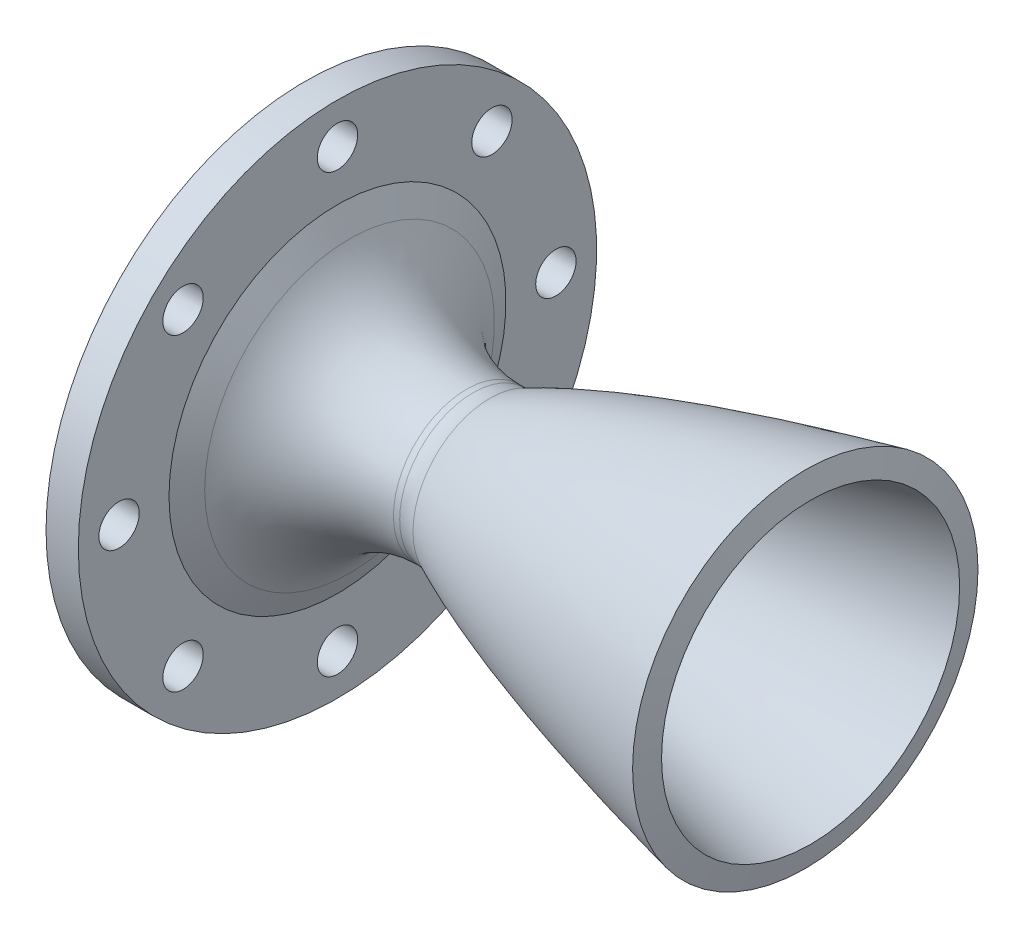
ISO-10303-21;
HEADER;
FILE_DESCRIPTION(('STEP AP214'),'2;1');
FILE_NAME('part.step','',(''),(''),'','','');
FILE_SCHEMA(('AUTOMOTIVE_DESIGN { 1 0 10303 214 1 1 1 1 }'));
ENDSEC;
DATA;
#1=APPLICATION_CONTEXT('core data for automotive mechanical design processes');
#2=APPLICATION_PROTOCOL_DEFINITION('international standard','automotive_design',2000,#1);
#3=PRODUCT_CONTEXT('',#1,'mechanical');
#4=PRODUCT('Part','Part','',(#3));
#5=PRODUCT_RELATED_PRODUCT_CATEGORY('part','',(#4));
#6=PRODUCT_DEFINITION_FORMATION('','',#4);
#7=PRODUCT_DEFINITION_CONTEXT('part definition',#1,'design');
#8=PRODUCT_DEFINITION('design','',#6,#7);
#9=PRODUCT_DEFINITION_SHAPE('','',#8);
#10=(LENGTH_UNIT() NAMED_UNIT(*) SI_UNIT(.MILLI.,.METRE.));
#11=(NAMED_UNIT(*) PLANE_ANGLE_UNIT() SI_UNIT($,.RADIAN.));
#12=(NAMED_UNIT(*) SI_UNIT($,.STERADIAN.) SOLID_ANGLE_UNIT());
#13=UNCERTAINTY_MEASURE_WITH_UNIT(LENGTH_MEASURE(1.E-05),#10,'distance_accuracy_value','');
#14=(GEOMETRIC_REPRESENTATION_CONTEXT(3) GLOBAL_UNCERTAINTY_ASSIGNED_CONTEXT((#13)) GLOBAL_UNIT_ASSIGNED_CONTEXT((#10,
#11,#12)) REPRESENTATION_CONTEXT('',''));
#15=CARTESIAN_POINT('',(0.,0.,0.));
#16=DIRECTION('',(0.,0.,1.));
#17=DIRECTION('',(1.,0.,0.));
#18=AXIS2_PLACEMENT_3D('',#15,#16,#17);
#19=CARTESIAN_POINT('',(-40.1017859271081,2.47516664872048,0.));
#20=DIRECTION('',(-1.,0.,0.));
#21=DIRECTION('',(0.,0.,1.));
#22=AXIS2_PLACEMENT_3D('',#19,#20,#21);
#23=CYLINDRICAL_SURFACE('',#22,32.1);
#24=CARTESIAN_POINT('',(-33.8674942617317,2.47516664872048,0.));
#25=DIRECTION('',(-1.,0.,0.));
#26=DIRECTION('',(0.,0.,1.));
#27=AXIS2_PLACEMENT_3D('',#24,#25,#26);
#28=CIRCLE('',#27,32.1);
#29=CARTESIAN_POINT('',(-33.8674942617317,2.47516664872048,32.1));
#30=VERTEX_POINT('',#29);
#31=EDGE_CURVE('E56',#30,#30,#28,.T.);
#32=ORIENTED_EDGE('',*,*,#31,.F.);
#33=EDGE_LOOP('',(#32));
#34=FACE_BOUND('',#33,.T.);
#35=CARTESIAN_POINT('',(-29.8674942617317,2.47516664872048,0.));
#36=DIRECTION('',(-1.,0.,0.));
#37=DIRECTION('',(0.,0.,1.));
#38=AXIS2_PLACEMENT_3D('',#35,#36,#37);
#39=CIRCLE('',#38,32.1);
#40=CARTESIAN_POINT('',(-29.8674942617317,2.47516664872048,32.1));
#41=VERTEX_POINT('',#40);
#42=EDGE_CURVE('E139',#41,#41,#39,.T.);
#43=ORIENTED_EDGE('',*,*,#42,.T.);
#44=EDGE_LOOP('',(#43));
#45=FACE_BOUND('',#44,.T.);
#46=ADVANCED_FACE('F43',(#34,#45),#23,.T.);
#47=CARTESIAN_POINT('',(-33.8674942617317,24.5751666487205,0.));
#48=DIRECTION('',(1.,0.,0.));
#49=DIRECTION('',(0.,0.,-1.));
#50=AXIS2_PLACEMENT_3D('',#47,#48,#49);
#51=PLANE('',#50);
#52=CARTESIAN_POINT('',(-33.8674942617317,29.5751666487205,0.));
#53=DIRECTION('',(1.,0.,0.));
#54=DIRECTION('',(0.,0.,-1.));
#55=AXIS2_PLACEMENT_3D('',#52,#53,#54);
#56=CIRCLE('',#55,2.5);
#57=CARTESIAN_POINT('',(-33.8674942617317,29.5751666487205,-2.5));
#58=VERTEX_POINT('',#57);
#59=EDGE_CURVE('E68',#58,#58,#56,.T.);
#60=ORIENTED_EDGE('',*,*,#59,.T.);
#61=EDGE_LOOP('',(#60));
#62=FACE_BOUND('',#61,.T.);
#63=CARTESIAN_POINT('',(-33.8674942617317,21.6521480783193,19.1278588875964));
#64=DIRECTION('',(1.,0.,0.));
#65=DIRECTION('',(0.,0.,-1.));
#66=AXIS2_PLACEMENT_3D('',#63,#64,#65);
#67=CIRCLE('',#66,2.5);
#68=CARTESIAN_POINT('',(-33.8674942617317,21.6521480783193,16.6278588875964));
#69=VERTEX_POINT('',#68);
#70=EDGE_CURVE('E69',#69,#69,#67,.T.);
#71=ORIENTED_EDGE('',*,*,#70,.T.);
#72=EDGE_LOOP('',(#71));
#73=FACE_BOUND('',#72,.T.);
#74=CARTESIAN_POINT('',(-33.8674942617317,2.52428919072291,27.0508774579976));
#75=DIRECTION('',(1.,0.,0.));
#76=DIRECTION('',(0.,0.,-1.));
#77=AXIS2_PLACEMENT_3D('',#74,#75,#76);
#78=CIRCLE('',#77,2.5);
#79=CARTESIAN_POINT('',(-33.8674942617317,2.52428919072291,24.5508774579976));
#80=VERTEX_POINT('',#79);
#81=EDGE_CURVE('E74',#80,#80,#78,.T.);
#82=ORIENTED_EDGE('',*,*,#81,.T.);
#83=EDGE_LOOP('',(#82));
#84=FACE_BOUND('',#83,.T.);
#85=CARTESIAN_POINT('',(-33.8674942617317,-16.6035696968735,19.1278588875964));
#86=DIRECTION('',(1.,0.,0.));
#87=DIRECTION('',(0.,0.,-1.));
#88=AXIS2_PLACEMENT_3D('',#85,#86,#87);
#89=CIRCLE('',#88,2.5);
#90=CARTESIAN_POINT('',(-33.8674942617317,-16.6035696968735,16.6278588875964));
#91=VERTEX_POINT('',#90);
#92=EDGE_CURVE('E79',#91,#91,#89,.T.);
#93=ORIENTED_EDGE('',*,*,#92,.T.);
#94=EDGE_LOOP('',(#93));
#95=FACE_BOUND('',#94,.T.);
#96=CARTESIAN_POINT('',(-33.8674942617317,-24.5265882672746,0.));
#97=DIRECTION('',(1.,0.,0.));
#98=DIRECTION('',(0.,0.,-1.));
#99=AXIS2_PLACEMENT_3D('',#96,#97,#98);
#100=CIRCLE('',#99,2.5);
#101=CARTESIAN_POINT('',(-33.8674942617317,-24.5265882672746,-2.5));
#102=VERTEX_POINT('',#101);
#103=EDGE_CURVE('E84',#102,#102,#100,.T.);
#104=ORIENTED_EDGE('',*,*,#103,.T.);
#105=EDGE_LOOP('',(#104));
#106=FACE_BOUND('',#105,.T.);
#107=CARTESIAN_POINT('',(-33.8674942617317,-16.6035696968735,-19.1278588875964));
#108=DIRECTION('',(1.,0.,0.));
#109=DIRECTION('',(0.,0.,-1.));
#110=AXIS2_PLACEMENT_3D('',#107,#108,#109);
#111=CIRCLE('',#110,2.5);
#112=CARTESIAN_POINT('',(-33.8674942617317,-16.6035696968735,-21.6278588875964));
#113=VERTEX_POINT('',#112);
#114=EDGE_CURVE('E89',#113,#113,#111,.T.);
#115=ORIENTED_EDGE('',*,*,#114,.T.);
#116=EDGE_LOOP('',(#115));
#117=FACE_BOUND('',#116,.T.);
#118=CARTESIAN_POINT('',(-33.8674942617317,2.52428919072291,-27.0508774579976));
#119=DIRECTION('',(1.,0.,0.));
#120=DIRECTION('',(0.,0.,-1.));
#121=AXIS2_PLACEMENT_3D('',#118,#119,#120);
#122=CIRCLE('',#121,2.5);
#123=CARTESIAN_POINT('',(-33.8674942617317,2.52428919072291,-29.5508774579976));
#124=VERTEX_POINT('',#123);
#125=EDGE_CURVE('E94',#124,#124,#122,.T.);
#126=ORIENTED_EDGE('',*,*,#125,.T.);
#127=EDGE_LOOP('',(#126));
#128=FACE_BOUND('',#127,.T.);
#129=CARTESIAN_POINT('',(-33.8674942617317,21.6521480783193,-19.1278588875964));
#130=DIRECTION('',(1.,0.,0.));
#131=DIRECTION('',(0.,0.,-1.));
#132=AXIS2_PLACEMENT_3D('',#129,#130,#131);
#133=CIRCLE('',#132,2.5);
#134=CARTESIAN_POINT('',(-33.8674942617317,21.6521480783193,-21.6278588875964));
#135=VERTEX_POINT('',#134);
#136=EDGE_CURVE('E99',#135,#135,#133,.T.);
#137=ORIENTED_EDGE('',*,*,#136,.T.);
#138=EDGE_LOOP('',(#137));
#139=FACE_BOUND('',#138,.T.);
#140=CARTESIAN_POINT('',(-33.8674942617317,2.47516664872048,0.));
#141=DIRECTION('',(-1.,0.,0.));
#142=DIRECTION('',(0.,0.,1.));
#143=AXIS2_PLACEMENT_3D('',#140,#141,#142);
#144=CIRCLE('',#143,22.1);
#145=CARTESIAN_POINT('',(-33.8674942617317,2.47516664872048,22.1));
#146=VERTEX_POINT('',#145);
#147=EDGE_CURVE('E61',#146,#146,#144,.T.);
#148=ORIENTED_EDGE('',*,*,#147,.F.);
#149=EDGE_LOOP('',(#148));
#150=FACE_BOUND('',#149,.T.);
#151=ORIENTED_EDGE('',*,*,#31,.T.);
#152=EDGE_LOOP('',(#151));
#153=FACE_BOUND('',#152,.T.);
#154=ADVANCED_FACE('F180',(#62,#73,#84,#95,#106,#117,#128,#139,#150,#153),#51,.F.);
#155=CARTESIAN_POINT('',(-33.8674942617317,2.47516664872048,0.));
#156=DIRECTION('',(-1.,0.,0.));
#157=DIRECTION('',(0.,0.,1.));
#158=AXIS2_PLACEMENT_3D('',#155,#156,#157);
#159=CONICAL_SURFACE('',#158,22.1,1.09804226754378);
#160=CARTESIAN_POINT('',(-31.0429654311442,2.47516664872048,0.));
#161=DIRECTION('',(-1.,0.,0.));
#162=DIRECTION('',(0.,0.,1.));
#163=AXIS2_PLACEMENT_3D('',#160,#161,#162);
#164=CIRCLE('',#163,16.5772525121334);
#165=CARTESIAN_POINT('',(-31.0429654311442,2.47516664872048,16.5772525121334));
#166=VERTEX_POINT('',#165);
#167=EDGE_CURVE('E107',#166,#166,#164,.T.);
#168=ORIENTED_EDGE('',*,*,#167,.F.);
#169=EDGE_LOOP('',(#168));
#170=FACE_BOUND('',#169,.T.);
#171=ORIENTED_EDGE('',*,*,#147,.T.);
#172=EDGE_LOOP('',(#171));
#173=FACE_BOUND('',#172,.T.);
#174=ADVANCED_FACE('F176',(#170,#173),#159,.F.);
#175=CARTESIAN_POINT('',(-13.8674942617317,2.47516664872048,0.));
#176=DIRECTION('',(-1.,0.,0.));
#177=DIRECTION('',(0.,0.,1.));
#178=AXIS2_PLACEMENT_3D('',#175,#176,#177);
#179=TOROIDAL_SURFACE('',#178,25.3613972885354,19.2913972885354);
#180=CARTESIAN_POINT('',(-13.8674942617317,2.47516664872048,0.));
#181=DIRECTION('',(-1.,0.,0.));
#182=DIRECTION('',(0.,0.,1.));
#183=AXIS2_PLACEMENT_3D('',#180,#181,#182);
#184=CIRCLE('',#183,6.07);
#185=CARTESIAN_POINT('',(-13.8674942617317,2.47516664872048,6.07));
#186=VERTEX_POINT('',#185);
#187=EDGE_CURVE('E111',#186,#186,#184,.T.);
#188=ORIENTED_EDGE('',*,*,#187,.F.);
#189=EDGE_LOOP('',(#188));
#190=FACE_BOUND('',#189,.T.);
#191=ORIENTED_EDGE('',*,*,#167,.T.);
#192=EDGE_LOOP('',(#191));
#193=FACE_BOUND('',#192,.T.);
#194=ADVANCED_FACE('F172',(#190,#193),#179,.T.);
#195=CARTESIAN_POINT('',(-40.1017859271081,2.47516664872048,0.));
#196=DIRECTION('',(-1.,0.,0.));
#197=DIRECTION('',(0.,0.,1.));
#198=AXIS2_PLACEMENT_3D('',#195,#196,#197);
#199=CYLINDRICAL_SURFACE('',#198,6.07);
#200=CARTESIAN_POINT('',(-11.2628437187715,2.47516664872048,0.));
#201=DIRECTION('',(-1.,0.,0.));
#202=DIRECTION('',(0.,0.,1.));
#203=AXIS2_PLACEMENT_3D('',#200,#201,#202);
#204=CIRCLE('',#203,6.07);
#205=CARTESIAN_POINT('',(-11.2628437187715,2.47516664872048,6.07));
#206=VERTEX_POINT('',#205);
#207=EDGE_CURVE('E115',#206,#206,#204,.T.);
#208=ORIENTED_EDGE('',*,*,#207,.F.);
#209=EDGE_LOOP('',(#208));
#210=FACE_BOUND('',#209,.T.);
#211=ORIENTED_EDGE('',*,*,#187,.T.);
#212=EDGE_LOOP('',(#211));
#213=FACE_BOUND('',#212,.T.);
#214=ADVANCED_FACE('F168',(#210,#213),#199,.F.);
#215=CARTESIAN_POINT('',(-11.2628437202166,8.5451666479965,0.));
#216=CARTESIAN_POINT('',(-11.1704410594149,8.59146234340708,0.));
#217=CARTESIAN_POINT('',(-10.9844878029856,8.68381146286285,0.));
#218=CARTESIAN_POINT('',(-10.5754895652672,8.88511502759375,0.));
#219=CARTESIAN_POINT('',(-10.1540615575437,9.08690757135863,0.));
#220=CARTESIAN_POINT('',(-9.67974792358082,9.3101856655338,0.));
#221=CARTESIAN_POINT('',(-9.18413714819353,9.53859943746503,0.));
#222=CARTESIAN_POINT('',(-8.63042617002927,9.78843016685588,0.));
#223=CARTESIAN_POINT('',(-8.01773238720454,10.0585048172262,0.));
#224=CARTESIAN_POINT('',(-7.19862191742622,10.4109854677113,0.));
#225=CARTESIAN_POINT('',(-6.17022199762688,10.8392437244766,0.));
#226=CARTESIAN_POINT('',(-4.96382019129255,11.3227369794277,0.));
#227=CARTESIAN_POINT('',(-3.57729882308945,11.8554320342333,0.));
#228=CARTESIAN_POINT('',(-2.14581567337746,12.3842839961738,0.));
#229=CARTESIAN_POINT('',(-0.358215928535983,13.0201995624111,0.));
#230=CARTESIAN_POINT('',(1.79014760564762,13.7495427125451,0.));
#231=CARTESIAN_POINT('',(4.30301149567443,14.5589411782354,0.));
#232=CARTESIAN_POINT('',(7.14474206251522,15.4251988551575,0.));
#233=CARTESIAN_POINT('',(9.9976094890332,16.2526182286502,0.));
#234=CARTESIAN_POINT('',(12.5028743400638,16.9469022464837,0.));
#235=CARTESIAN_POINT('',(14.6544906366279,17.5228768796072,0.));
#236=CARTESIAN_POINT('',(16.4519604173846,17.9915371934645,0.));
#237=CARTESIAN_POINT('',(17.8891445557143,18.3592888307294,0.));
#238=CARTESIAN_POINT('',(19.333055984898,18.7219091745531,0.));
#239=CARTESIAN_POINT('',(20.7689304476629,19.0764140294032,0.));
#240=CARTESIAN_POINT('',(22.0424827452051,19.3852006192132,0.));
#241=CARTESIAN_POINT('',(23.1087890028986,19.6406136155214,0.));
#242=CARTESIAN_POINT('',(24.0407741960624,19.8608930084722,0.));
#243=CARTESIAN_POINT('',(24.7076264255003,20.0180909903611,0.));
#244=CARTESIAN_POINT('',(25.7285162119527,20.2549834255515,0.));
#245=CARTESIAN_POINT('',(26.575325658845,20.45176279906,0.));
#246=CARTESIAN_POINT('',(27.8069779563923,20.7312022339886,0.));
#247=CARTESIAN_POINT('',(28.4245227349194,20.87060224574,0.));
#248=CARTESIAN_POINT('',(28.7270485219971,20.9385085280617,0.));
#249=B_SPLINE_CURVE_WITH_KNOTS('',4,(#215,#216,#217,#218,#219,#220,#221,#222,#223,#224,#225,
#226,#227,#228,#229,#230,#231,#232,#233,#234,#235,#236,#237,#238,#239,#240,#241,#242,#243,#244,
#245,#246,#247,#248),.UNSPECIFIED.,.F.,.F.,(5,1,1,1,1,1,1,1,1,1,1,1,1,1,1,1,1,1,1,1,1,1,1,1,1,1,
1,1,1,1,5),(0.0834996550678079,0.093353560602658,0.103207466177351,0.113061323495502,
0.122915180813652,0.134784595530776,0.146654010247901,0.161434814833603,0.176215619419305,
0.205777187867874,0.235338798099936,0.264900393411024,0.294461996100397,0.327264292288231,
0.386387484255726,0.445510682453015,0.504633878157806,0.563757076826583,0.622880273665945,
0.652441872787443,0.682003471908941,0.711565070450698,0.741126668992456,0.770688267582537,
0.800249866172618,0.815030665389756,0.829811464606894,0.844592263824031,0.859373063041169,
0.888934660882481,0.918496258762739),.UNSPECIFIED.);
#250=CARTESIAN_POINT('',(-40.1017859271081,2.47516664872048,0.));
#251=DIRECTION('',(-1.,0.,0.));
#252=AXIS1_PLACEMENT('',#250,#251);
#253=SURFACE_OF_REVOLUTION('',#249,#252);
#254=CARTESIAN_POINT('',(28.7270485219971,2.47516664872048,0.));
#255=DIRECTION('',(-1.,0.,0.));
#256=DIRECTION('',(0.,0.,1.));
#257=AXIS2_PLACEMENT_3D('',#254,#255,#256);
#258=CIRCLE('',#257,18.4633418793413);
#259=CARTESIAN_POINT('',(28.7270485219971,2.47516664872048,18.4633418793413));
#260=VERTEX_POINT('',#259);
#261=EDGE_CURVE('E119',#260,#260,#258,.T.);
#262=ORIENTED_EDGE('',*,*,#261,.F.);
#263=EDGE_LOOP('',(#262));
#264=FACE_BOUND('',#263,.T.);
#265=ORIENTED_EDGE('',*,*,#207,.T.);
#266=EDGE_LOOP('',(#265));
#267=FACE_BOUND('',#266,.T.);
#268=ADVANCED_FACE('F164',(#264,#267),#253,.T.);
#269=CARTESIAN_POINT('',(28.7270485219971,2.47516664872048,0.));
#270=DIRECTION('',(-1.,0.,0.));
#271=DIRECTION('',(0.,0.,1.));
#272=AXIS2_PLACEMENT_3D('',#269,#270,#271);
#273=CONICAL_SURFACE('',#272,18.4633418793413,1.34999169417867);
#274=CARTESIAN_POINT('',(28.0700041481886,2.47516664872048,0.));
#275=DIRECTION('',(-1.,0.,0.));
#276=DIRECTION('',(0.,0.,1.));
#277=AXIS2_PLACEMENT_3D('',#274,#275,#276);
#278=CIRCLE('',#277,21.3905064956306);
#279=CARTESIAN_POINT('',(28.0700041481886,2.47516664872048,21.3905064956306));
#280=VERTEX_POINT('',#279);
#281=EDGE_CURVE('E123',#280,#280,#278,.T.);
#282=ORIENTED_EDGE('',*,*,#281,.F.);
#283=EDGE_LOOP('',(#282));
#284=FACE_BOUND('',#283,.T.);
#285=ORIENTED_EDGE('',*,*,#261,.T.);
#286=EDGE_LOOP('',(#285));
#287=FACE_BOUND('',#286,.T.);
#288=ADVANCED_FACE('F160',(#284,#287),#273,.T.);
#289=CARTESIAN_POINT('',(28.0700041481886,23.8656731443511,0.));
#290=CARTESIAN_POINT('',(27.8838609494425,23.8238906149083,0.));
#291=CARTESIAN_POINT('',(27.5362959126043,23.7455767317207,0.));
#292=CARTESIAN_POINT('',(26.8671961300056,23.5940376090018,0.));
#293=CARTESIAN_POINT('',(26.1454585299366,23.4297612432549,0.));
#294=CARTESIAN_POINT('',(25.5057430237634,23.2829363894341,0.));
#295=CARTESIAN_POINT('',(24.939210748867,23.1515877312432,0.));
#296=CARTESIAN_POINT('',(24.2697193061066,22.9961872139758,0.));
#297=CARTESIAN_POINT('',(23.6318451829211,22.8468094359267,0.));
#298=CARTESIAN_POINT('',(22.814394965333,22.6537959030994,0.));
#299=CARTESIAN_POINT('',(21.7395946282258,22.3979654484581,0.));
#300=CARTESIAN_POINT('',(20.0676608588631,21.9936593435639,0.));
#301=CARTESIAN_POINT('',(15.4289598895864,20.8476938232466,0.));
#302=CARTESIAN_POINT('',(7.88585049956268,18.8369735409048,0.));
#303=CARTESIAN_POINT('',(-0.45019804706077,16.2334151294487,0.));
#304=CARTESIAN_POINT('',(-6.23354237038004,14.0718446080339,0.));
#305=CARTESIAN_POINT('',(-9.09923833167396,12.8677094942143,0.));
#306=CARTESIAN_POINT('',(-10.5335314646272,12.2219759600956,0.));
#307=CARTESIAN_POINT('',(-11.3385785504298,11.8458776384617,0.));
#308=CARTESIAN_POINT('',(-11.7564571363918,11.6456193257171,0.));
#309=CARTESIAN_POINT('',(-11.9625824642066,11.5451666487204,0.));
#310=B_SPLINE_CURVE_WITH_KNOTS('',3,(#289,#290,#291,#292,#293,#294,#295,#296,#297,#298,#299,
#300,#301,#302,#303,#304,#305,#306,#307,#308,#309),.UNSPECIFIED.,.F.,.F.,(4,1,1,1,1,1,1,1,1,1,1,
1,1,1,1,1,1,1,4),(0.0972888627316728,0.110120228294638,0.122951593857603,0.135782959420568,
0.148614324983533,0.161445690546498,0.174277056109463,0.187108421672428,0.199939787235393,
0.225602518361323,0.251265249487253,0.302590711739113,0.507892560746554,0.713194409753994,
0.815845334257714,0.867170796509574,0.892833527635504,0.905664893198469,0.918496258761434),.UNSPECIFIED.);
#311=CARTESIAN_POINT('',(-40.1017859271081,2.47516664872048,0.));
#312=DIRECTION('',(-1.,0.,0.));
#313=AXIS1_PLACEMENT('',#311,#312);
#314=SURFACE_OF_REVOLUTION('',#310,#313);
#315=CARTESIAN_POINT('',(-10.9793210498691,2.47516664872048,0.));
#316=DIRECTION('',(-1.,0.,0.));
#317=DIRECTION('',(0.,0.,1.));
#318=AXIS2_PLACEMENT_3D('',#315,#316,#317);
#319=CIRCLE('',#318,9.53821959961478);
#320=CARTESIAN_POINT('',(-10.9793210498691,2.47516664872048,9.53821959961478));
#321=VERTEX_POINT('',#320);
#322=EDGE_CURVE('E10',#321,#321,#319,.F.);
#323=ORIENTED_EDGE('',*,*,#322,.T.);
#324=EDGE_LOOP('',(#323));
#325=FACE_BOUND('',#324,.T.);
#326=ORIENTED_EDGE('',*,*,#281,.T.);
#327=EDGE_LOOP('',(#326));
#328=FACE_BOUND('',#327,.T.);
#329=ADVANCED_FACE('F155',(#325,#328),#314,.T.);
#330=CARTESIAN_POINT('',(-40.1017859271081,2.47516664872048,0.));
#331=DIRECTION('',(-1.,0.,0.));
#332=DIRECTION('',(0.,0.,1.));
#333=AXIS2_PLACEMENT_3D('',#330,#331,#332);
#334=CYLINDRICAL_SURFACE('',#333,9.06999999999996);
#335=CARTESIAN_POINT('',(-13.0918944575131,2.47516664872048,0.));
#336=DIRECTION('',(-1.,0.,0.));
#337=DIRECTION('',(0.,0.,1.));
#338=AXIS2_PLACEMENT_3D('',#335,#336,#337);
#339=CIRCLE('',#338,9.06999999999996);
#340=CARTESIAN_POINT('',(-13.0918944575131,2.47516664872048,9.06999999999996));
#341=VERTEX_POINT('',#340);
#342=EDGE_CURVE('E51',#341,#341,#339,.T.);
#343=ORIENTED_EDGE('',*,*,#342,.T.);
#344=EDGE_LOOP('',(#343));
#345=FACE_BOUND('',#344,.T.);
#346=CARTESIAN_POINT('',(-13.8674942617317,2.47516664872048,0.));
#347=DIRECTION('',(-1.,0.,0.));
#348=DIRECTION('',(0.,0.,1.));
#349=AXIS2_PLACEMENT_3D('',#346,#347,#348);
#350=CIRCLE('',#349,9.07);
#351=CARTESIAN_POINT('',(-13.8674942617317,2.47516664872048,9.07));
#352=VERTEX_POINT('',#351);
#353=EDGE_CURVE('E127',#352,#352,#350,.T.);
#354=ORIENTED_EDGE('',*,*,#353,.F.);
#355=EDGE_LOOP('',(#354));
#356=FACE_BOUND('',#355,.T.);
#357=ADVANCED_FACE('F159',(#345,#356),#334,.T.);
#358=CARTESIAN_POINT('',(-13.8674942617317,2.47516664872048,0.));
#359=DIRECTION('',(-1.,0.,0.));
#360=DIRECTION('',(0.,0.,1.));
#361=AXIS2_PLACEMENT_3D('',#358,#359,#360);
#362=TOROIDAL_SURFACE('',#361,25.3613972885354,16.2913972885354);
#363=CARTESIAN_POINT('',(-28.3720125324208,2.47516664872048,0.));
#364=DIRECTION('',(-1.,0.,0.));
#365=DIRECTION('',(0.,0.,1.));
#366=AXIS2_PLACEMENT_3D('',#363,#364,#365);
#367=CIRCLE('',#366,17.9432725020316);
#368=CARTESIAN_POINT('',(-28.3720125324208,2.47516664872048,17.9432725020316));
#369=VERTEX_POINT('',#368);
#370=EDGE_CURVE('E131',#369,#369,#367,.T.);
#371=ORIENTED_EDGE('',*,*,#370,.F.);
#372=EDGE_LOOP('',(#371));
#373=FACE_BOUND('',#372,.T.);
#374=ORIENTED_EDGE('',*,*,#353,.T.);
#375=EDGE_LOOP('',(#374));
#376=FACE_BOUND('',#375,.T.);
#377=ADVANCED_FACE('F203',(#373,#376),#362,.F.);
#378=CARTESIAN_POINT('',(-28.3720125324208,2.47516664872048,0.));
#379=DIRECTION('',(-1.,0.,0.));
#380=DIRECTION('',(0.,0.,1.));
#381=AXIS2_PLACEMENT_3D('',#378,#379,#380);
#382=CONICAL_SURFACE('',#381,17.9432725020316,1.09804226754377);
#383=CARTESIAN_POINT('',(-29.8674942617317,2.47516664872048,0.));
#384=DIRECTION('',(-1.,0.,0.));
#385=DIRECTION('',(0.,0.,1.));
#386=AXIS2_PLACEMENT_3D('',#383,#384,#385);
#387=CIRCLE('',#386,20.8673594769143);
#388=CARTESIAN_POINT('',(-29.8674942617317,2.47516664872048,20.8673594769143));
#389=VERTEX_POINT('',#388);
#390=EDGE_CURVE('E135',#389,#389,#387,.T.);
#391=ORIENTED_EDGE('',*,*,#390,.F.);
#392=EDGE_LOOP('',(#391));
#393=FACE_BOUND('',#392,.T.);
#394=ORIENTED_EDGE('',*,*,#370,.T.);
#395=EDGE_LOOP('',(#394));
#396=FACE_BOUND('',#395,.T.);
#397=ADVANCED_FACE('F196',(#393,#396),#382,.T.);
#398=CARTESIAN_POINT('',(-29.8674942617317,23.3425261256348,0.));
#399=DIRECTION('',(-1.,0.,0.));
#400=DIRECTION('',(0.,0.,1.));
#401=AXIS2_PLACEMENT_3D('',#398,#399,#400);
#402=PLANE('',#401);
#403=CARTESIAN_POINT('',(-29.8674942617317,29.5751666487205,0.));
#404=DIRECTION('',(-1.,0.,0.));
#405=DIRECTION('',(0.,0.,1.));
#406=AXIS2_PLACEMENT_3D('',#403,#404,#405);
#407=CIRCLE('',#406,2.5);
#408=CARTESIAN_POINT('',(-29.8674942617317,29.5751666487205,2.5));
#409=VERTEX_POINT('',#408);
#410=EDGE_CURVE('E64',#409,#409,#407,.T.);
#411=ORIENTED_EDGE('',*,*,#410,.T.);
#412=EDGE_LOOP('',(#411));
#413=FACE_BOUND('',#412,.T.);
#414=CARTESIAN_POINT('',(-29.8674942617317,21.6521480783193,19.1278588875964));
#415=DIRECTION('',(-1.,0.,0.));
#416=DIRECTION('',(0.,0.,1.));
#417=AXIS2_PLACEMENT_3D('',#414,#415,#416);
#418=CIRCLE('',#417,2.5);
#419=CARTESIAN_POINT('',(-29.8674942617317,21.6521480783193,21.6278588875964));
#420=VERTEX_POINT('',#419);
#421=EDGE_CURVE('E70',#420,#420,#418,.T.);
#422=ORIENTED_EDGE('',*,*,#421,.T.);
#423=EDGE_LOOP('',(#422));
#424=FACE_BOUND('',#423,.T.);
#425=CARTESIAN_POINT('',(-29.8674942617317,2.52428919072291,27.0508774579976));
#426=DIRECTION('',(-1.,0.,0.));
#427=DIRECTION('',(0.,0.,1.));
#428=AXIS2_PLACEMENT_3D('',#425,#426,#427);
#429=CIRCLE('',#428,2.5);
#430=CARTESIAN_POINT('',(-29.8674942617317,2.52428919072291,29.5508774579976));
#431=VERTEX_POINT('',#430);
#432=EDGE_CURVE('E75',#431,#431,#429,.T.);
#433=ORIENTED_EDGE('',*,*,#432,.T.);
#434=EDGE_LOOP('',(#433));
#435=FACE_BOUND('',#434,.T.);
#436=CARTESIAN_POINT('',(-29.8674942617317,-16.6035696968735,19.1278588875964));
#437=DIRECTION('',(-1.,0.,0.));
#438=DIRECTION('',(0.,0.,1.));
#439=AXIS2_PLACEMENT_3D('',#436,#437,#438);
#440=CIRCLE('',#439,2.5);
#441=CARTESIAN_POINT('',(-29.8674942617317,-16.6035696968735,21.6278588875964));
#442=VERTEX_POINT('',#441);
#443=EDGE_CURVE('E80',#442,#442,#440,.T.);
#444=ORIENTED_EDGE('',*,*,#443,.T.);
#445=EDGE_LOOP('',(#444));
#446=FACE_BOUND('',#445,.T.);
#447=CARTESIAN_POINT('',(-29.8674942617317,-24.5265882672746,0.));
#448=DIRECTION('',(-1.,0.,0.));
#449=DIRECTION('',(0.,0.,1.));
#450=AXIS2_PLACEMENT_3D('',#447,#448,#449);
#451=CIRCLE('',#450,2.5);
#452=CARTESIAN_POINT('',(-29.8674942617317,-24.5265882672746,2.5));
#453=VERTEX_POINT('',#452);
#454=EDGE_CURVE('E85',#453,#453,#451,.T.);
#455=ORIENTED_EDGE('',*,*,#454,.T.);
#456=EDGE_LOOP('',(#455));
#457=FACE_BOUND('',#456,.T.);
#458=CARTESIAN_POINT('',(-29.8674942617317,-16.6035696968735,-19.1278588875964));
#459=DIRECTION('',(-1.,0.,0.));
#460=DIRECTION('',(0.,0.,1.));
#461=AXIS2_PLACEMENT_3D('',#458,#459,#460);
#462=CIRCLE('',#461,2.5);
#463=CARTESIAN_POINT('',(-29.8674942617317,-16.6035696968735,-16.6278588875964));
#464=VERTEX_POINT('',#463);
#465=EDGE_CURVE('E90',#464,#464,#462,.T.);
#466=ORIENTED_EDGE('',*,*,#465,.T.);
#467=EDGE_LOOP('',(#466));
#468=FACE_BOUND('',#467,.T.);
#469=CARTESIAN_POINT('',(-29.8674942617317,2.52428919072291,-27.0508774579976));
#470=DIRECTION('',(-1.,0.,0.));
#471=DIRECTION('',(0.,0.,1.));
#472=AXIS2_PLACEMENT_3D('',#469,#470,#471);
#473=CIRCLE('',#472,2.5);
#474=CARTESIAN_POINT('',(-29.8674942617317,2.52428919072291,-24.5508774579976));
#475=VERTEX_POINT('',#474);
#476=EDGE_CURVE('E95',#475,#475,#473,.T.);
#477=ORIENTED_EDGE('',*,*,#476,.T.);
#478=EDGE_LOOP('',(#477));
#479=FACE_BOUND('',#478,.T.);
#480=CARTESIAN_POINT('',(-29.8674942617317,21.6521480783193,-19.1278588875964));
#481=DIRECTION('',(-1.,0.,0.));
#482=DIRECTION('',(0.,0.,1.));
#483=AXIS2_PLACEMENT_3D('',#480,#481,#482);
#484=CIRCLE('',#483,2.5);
#485=CARTESIAN_POINT('',(-29.8674942617317,21.6521480783193,-16.6278588875964));
#486=VERTEX_POINT('',#485);
#487=EDGE_CURVE('E100',#486,#486,#484,.T.);
#488=ORIENTED_EDGE('',*,*,#487,.T.);
#489=EDGE_LOOP('',(#488));
#490=FACE_BOUND('',#489,.T.);
#491=ORIENTED_EDGE('',*,*,#42,.F.);
#492=EDGE_LOOP('',(#491));
#493=FACE_BOUND('',#492,.T.);
#494=ORIENTED_EDGE('',*,*,#390,.T.);
#495=EDGE_LOOP('',(#494));
#496=FACE_BOUND('',#495,.T.);
#497=ADVANCED_FACE('F192',(#413,#424,#435,#446,#457,#468,#479,#490,#493,#496),#402,.F.);
#498=CARTESIAN_POINT('',(28.7270485219971,21.6521480783193,-19.1278588875964));
#499=DIRECTION('',(-1.,0.,0.));
#500=DIRECTION('',(0.,0.,1.));
#501=AXIS2_PLACEMENT_3D('',#498,#499,#500);
#502=CYLINDRICAL_SURFACE('',#501,2.5);
#503=ORIENTED_EDGE('',*,*,#487,.F.);
#504=EDGE_LOOP('',(#503));
#505=FACE_BOUND('',#504,.T.);
#506=ORIENTED_EDGE('',*,*,#136,.F.);
#507=EDGE_LOOP('',(#506));
#508=FACE_BOUND('',#507,.T.);
#509=ADVANCED_FACE('F195',(#505,#508),#502,.F.);
#510=CARTESIAN_POINT('',(28.7270485219971,2.52428919072291,-27.0508774579976));
#511=DIRECTION('',(-1.,0.,0.));
#512=DIRECTION('',(0.,0.,1.));
#513=AXIS2_PLACEMENT_3D('',#510,#511,#512);
#514=CYLINDRICAL_SURFACE('',#513,2.5);
#515=ORIENTED_EDGE('',*,*,#476,.F.);
#516=EDGE_LOOP('',(#515));
#517=FACE_BOUND('',#516,.T.);
#518=ORIENTED_EDGE('',*,*,#125,.F.);
#519=EDGE_LOOP('',(#518));
#520=FACE_BOUND('',#519,.T.);
#521=ADVANCED_FACE('F285',(#517,#520),#514,.F.);
#522=CARTESIAN_POINT('',(28.7270485219971,-16.6035696968735,-19.1278588875964));
#523=DIRECTION('',(-1.,0.,0.));
#524=DIRECTION('',(0.,0.,1.));
#525=AXIS2_PLACEMENT_3D('',#522,#523,#524);
#526=CYLINDRICAL_SURFACE('',#525,2.5);
#527=ORIENTED_EDGE('',*,*,#465,.F.);
#528=EDGE_LOOP('',(#527));
#529=FACE_BOUND('',#528,.T.);
#530=ORIENTED_EDGE('',*,*,#114,.F.);
#531=EDGE_LOOP('',(#530));
#532=FACE_BOUND('',#531,.T.);
#533=ADVANCED_FACE('F275',(#529,#532),#526,.F.);
#534=CARTESIAN_POINT('',(28.7270485219971,-24.5265882672746,0.));
#535=DIRECTION('',(-1.,0.,0.));
#536=DIRECTION('',(0.,0.,1.));
#537=AXIS2_PLACEMENT_3D('',#534,#535,#536);
#538=CYLINDRICAL_SURFACE('',#537,2.5);
#539=ORIENTED_EDGE('',*,*,#454,.F.);
#540=EDGE_LOOP('',(#539));
#541=FACE_BOUND('',#540,.T.);
#542=ORIENTED_EDGE('',*,*,#103,.F.);
#543=EDGE_LOOP('',(#542));
#544=FACE_BOUND('',#543,.T.);
#545=ADVANCED_FACE('F265',(#541,#544),#538,.F.);
#546=CARTESIAN_POINT('',(28.7270485219971,-16.6035696968735,19.1278588875964));
#547=DIRECTION('',(-1.,0.,0.));
#548=DIRECTION('',(0.,0.,1.));
#549=AXIS2_PLACEMENT_3D('',#546,#547,#548);
#550=CYLINDRICAL_SURFACE('',#549,2.5);
#551=ORIENTED_EDGE('',*,*,#443,.F.);
#552=EDGE_LOOP('',(#551));
#553=FACE_BOUND('',#552,.T.);
#554=ORIENTED_EDGE('',*,*,#92,.F.);
#555=EDGE_LOOP('',(#554));
#556=FACE_BOUND('',#555,.T.);
#557=ADVANCED_FACE('F255',(#553,#556),#550,.F.);
#558=CARTESIAN_POINT('',(28.7270485219971,2.52428919072291,27.0508774579976));
#559=DIRECTION('',(-1.,0.,0.));
#560=DIRECTION('',(0.,0.,1.));
#561=AXIS2_PLACEMENT_3D('',#558,#559,#560);
#562=CYLINDRICAL_SURFACE('',#561,2.5);
#563=ORIENTED_EDGE('',*,*,#432,.F.);
#564=EDGE_LOOP('',(#563));
#565=FACE_BOUND('',#564,.T.);
#566=ORIENTED_EDGE('',*,*,#81,.F.);
#567=EDGE_LOOP('',(#566));
#568=FACE_BOUND('',#567,.T.);
#569=ADVANCED_FACE('F245',(#565,#568),#562,.F.);
#570=CARTESIAN_POINT('',(28.7270485219971,21.6521480783193,19.1278588875964));
#571=DIRECTION('',(-1.,0.,0.));
#572=DIRECTION('',(0.,0.,1.));
#573=AXIS2_PLACEMENT_3D('',#570,#571,#572);
#574=CYLINDRICAL_SURFACE('',#573,2.5);
#575=ORIENTED_EDGE('',*,*,#421,.F.);
#576=EDGE_LOOP('',(#575));
#577=FACE_BOUND('',#576,.T.);
#578=ORIENTED_EDGE('',*,*,#70,.F.);
#579=EDGE_LOOP('',(#578));
#580=FACE_BOUND('',#579,.T.);
#581=ADVANCED_FACE('F235',(#577,#580),#574,.F.);
#582=CARTESIAN_POINT('',(28.7270485219971,29.5751666487205,0.));
#583=DIRECTION('',(-1.,0.,0.));
#584=DIRECTION('',(0.,0.,1.));
#585=AXIS2_PLACEMENT_3D('',#582,#583,#584);
#586=CYLINDRICAL_SURFACE('',#585,2.5);
#587=ORIENTED_EDGE('',*,*,#410,.F.);
#588=EDGE_LOOP('',(#587));
#589=FACE_BOUND('',#588,.T.);
#590=ORIENTED_EDGE('',*,*,#59,.F.);
#591=EDGE_LOOP('',(#590));
#592=FACE_BOUND('',#591,.T.);
#593=ADVANCED_FACE('F224',(#589,#592),#586,.F.);
#594=CARTESIAN_POINT('',(-13.0918944575131,2.47516664872048,0.));
#595=DIRECTION('',(-1.,0.,0.));
#596=DIRECTION('',(0.,0.,1.));
#597=AXIS2_PLACEMENT_3D('',#594,#595,#596);
#598=TOROIDAL_SURFACE('',#597,14.07,5.);
#599=ORIENTED_EDGE('',*,*,#322,.F.);
#600=EDGE_LOOP('',(#599));
#601=FACE_BOUND('',#600,.T.);
#602=ORIENTED_EDGE('',*,*,#342,.F.);
#603=EDGE_LOOP('',(#602));
#604=FACE_BOUND('',#603,.T.);
#605=ADVANCED_FACE('F45',(#601,#604),#598,.F.);
#606=CLOSED_SHELL('',(#46,#154,#174,#194,#214,#268,#288,#329,#357,#377,#397,#497,#509,#521,#533,
#545,#557,#569,#581,#593,#605));
#607=MANIFOLD_SOLID_BREP('B2',#606);
#608=ADVANCED_BREP_SHAPE_REPRESENTATION('',(#18,#607),#14);
#609=SHAPE_DEFINITION_REPRESENTATION(#9,#608);
ENDSEC;
END-ISO-10303-21;
